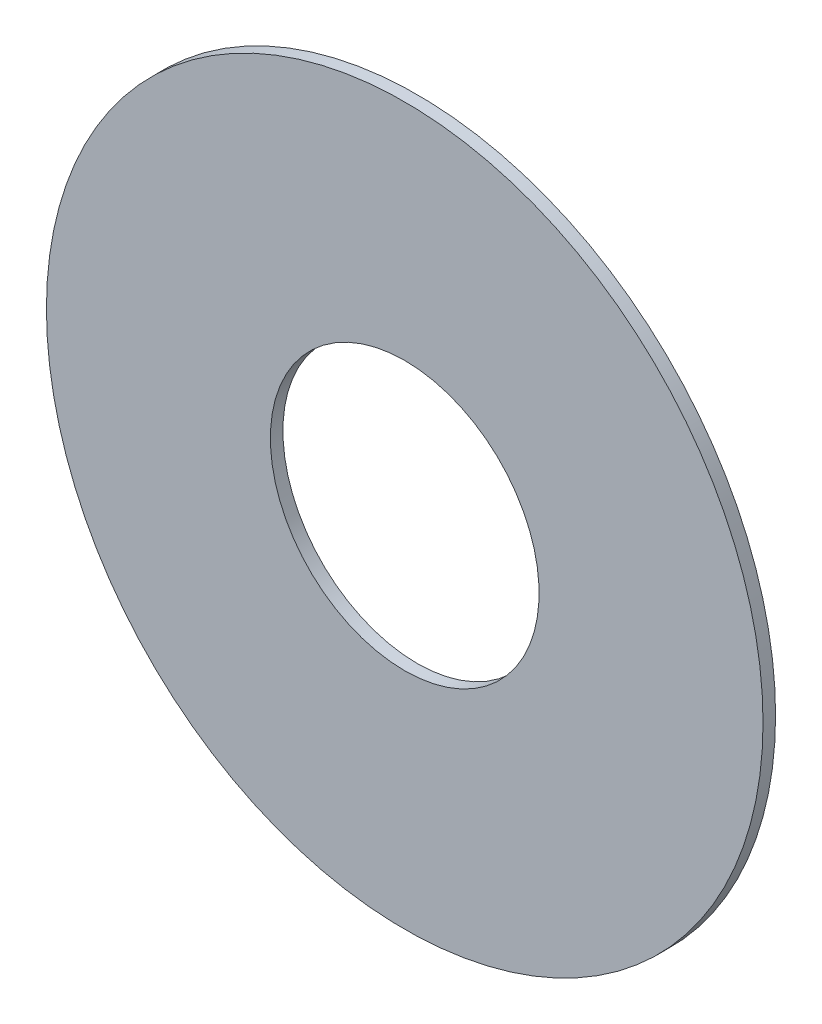
ISO-10303-21;
HEADER;
FILE_DESCRIPTION(('STEP AP214'),'2;1');
FILE_NAME('part.step','',(''),(''),'','','');
FILE_SCHEMA(('AUTOMOTIVE_DESIGN { 1 0 10303 214 1 1 1 1 }'));
ENDSEC;
DATA;
#1=APPLICATION_CONTEXT('core data for automotive mechanical design processes');
#2=APPLICATION_PROTOCOL_DEFINITION('international standard','automotive_design',2000,#1);
#3=PRODUCT_CONTEXT('',#1,'mechanical');
#4=PRODUCT('Part','Part','',(#3));
#5=PRODUCT_RELATED_PRODUCT_CATEGORY('part','',(#4));
#6=PRODUCT_DEFINITION_FORMATION('','',#4);
#7=PRODUCT_DEFINITION_CONTEXT('part definition',#1,'design');
#8=PRODUCT_DEFINITION('design','',#6,#7);
#9=PRODUCT_DEFINITION_SHAPE('','',#8);
#10=(LENGTH_UNIT() NAMED_UNIT(*) SI_UNIT(.MILLI.,.METRE.));
#11=(NAMED_UNIT(*) PLANE_ANGLE_UNIT() SI_UNIT($,.RADIAN.));
#12=(NAMED_UNIT(*) SI_UNIT($,.STERADIAN.) SOLID_ANGLE_UNIT());
#13=UNCERTAINTY_MEASURE_WITH_UNIT(LENGTH_MEASURE(1.E-05),#10,'distance_accuracy_value','');
#14=(GEOMETRIC_REPRESENTATION_CONTEXT(3) GLOBAL_UNCERTAINTY_ASSIGNED_CONTEXT((#13)) GLOBAL_UNIT_ASSIGNED_CONTEXT((#10,
#11,#12)) REPRESENTATION_CONTEXT('',''));
#15=CARTESIAN_POINT('',(0.,0.,0.));
#16=DIRECTION('',(0.,0.,1.));
#17=DIRECTION('',(1.,0.,0.));
#18=AXIS2_PLACEMENT_3D('',#15,#16,#17);
#19=CARTESIAN_POINT('',(146.304,-73.152,-0.045));
#20=DIRECTION('',(0.,0.,-1.));
#21=DIRECTION('',(0.,-1.,0.));
#22=AXIS2_PLACEMENT_3D('',#19,#20,#21);
#23=CYLINDRICAL_SURFACE('',#22,0.375);
#24=CARTESIAN_POINT('',(146.304,-73.152,-0.035));
#25=DIRECTION('',(0.,0.,-1.));
#26=DIRECTION('',(0.,-1.,0.));
#27=AXIS2_PLACEMENT_3D('',#24,#25,#26);
#28=CIRCLE('',#27,0.375);
#29=CARTESIAN_POINT('',(146.304,-73.527,-0.035));
#30=VERTEX_POINT('',#29);
#31=EDGE_CURVE('E26',#30,#30,#28,.T.);
#32=ORIENTED_EDGE('',*,*,#31,.T.);
#33=DIRECTION('',(0.,0.,1.));
#34=VECTOR('',#33,1.);
#35=CARTESIAN_POINT('',(146.304,-73.527,-0.045));
#36=LINE('',#35,#34);
#37=CARTESIAN_POINT('',(146.304,-73.527,0.));
#38=VERTEX_POINT('',#37);
#39=EDGE_CURVE('E11',#30,#38,#36,.T.);
#40=ORIENTED_EDGE('',*,*,#39,.T.);
#41=CARTESIAN_POINT('',(146.304,-73.152,0.));
#42=DIRECTION('',(0.,0.,-1.));
#43=DIRECTION('',(0.,-1.,0.));
#44=AXIS2_PLACEMENT_3D('',#41,#42,#43);
#45=CIRCLE('',#44,0.375);
#46=EDGE_CURVE('E70',#38,#38,#45,.T.);
#47=ORIENTED_EDGE('',*,*,#46,.F.);
#48=ORIENTED_EDGE('',*,*,#39,.F.);
#49=EDGE_LOOP('',(#32,#40,#47,#48));
#50=FACE_BOUND('',#49,.T.);
#51=ADVANCED_FACE('F17',(#50),#23,.F.);
#52=CARTESIAN_POINT('',(146.304,-73.152,-0.035));
#53=DIRECTION('',(0.,0.,1.));
#54=DIRECTION('',(1.,0.,0.));
#55=AXIS2_PLACEMENT_3D('',#52,#53,#54);
#56=PLANE('',#55);
#57=ORIENTED_EDGE('',*,*,#31,.F.);
#58=EDGE_LOOP('',(#57));
#59=FACE_BOUND('',#58,.T.);
#60=CARTESIAN_POINT('',(146.304,-73.152,-0.035));
#61=DIRECTION('',(0.,0.,1.));
#62=DIRECTION('',(1.,0.,0.));
#63=AXIS2_PLACEMENT_3D('',#60,#61,#62);
#64=CIRCLE('',#63,1.);
#65=CARTESIAN_POINT('',(147.304,-73.152,-0.035));
#66=VERTEX_POINT('',#65);
#67=EDGE_CURVE('E57',#66,#66,#64,.T.);
#68=ORIENTED_EDGE('',*,*,#67,.F.);
#69=EDGE_LOOP('',(#68));
#70=FACE_BOUND('',#69,.T.);
#71=ADVANCED_FACE('F19',(#59,#70),#56,.F.);
#72=CARTESIAN_POINT('',(146.304,-73.152,0.));
#73=DIRECTION('',(0.,0.,1.));
#74=DIRECTION('',(1.,0.,0.));
#75=AXIS2_PLACEMENT_3D('',#72,#73,#74);
#76=PLANE('',#75);
#77=ORIENTED_EDGE('',*,*,#46,.T.);
#78=EDGE_LOOP('',(#77));
#79=FACE_BOUND('',#78,.T.);
#80=CARTESIAN_POINT('',(146.304,-73.152,0.));
#81=DIRECTION('',(0.,0.,1.));
#82=DIRECTION('',(1.,0.,0.));
#83=AXIS2_PLACEMENT_3D('',#80,#81,#82);
#84=CIRCLE('',#83,1.);
#85=CARTESIAN_POINT('',(147.304,-73.152,0.));
#86=VERTEX_POINT('',#85);
#87=EDGE_CURVE('E55',#86,#86,#84,.T.);
#88=ORIENTED_EDGE('',*,*,#87,.T.);
#89=EDGE_LOOP('',(#88));
#90=FACE_BOUND('',#89,.T.);
#91=ADVANCED_FACE('F61',(#79,#90),#76,.T.);
#92=CARTESIAN_POINT('',(146.304,-73.152,-0.035));
#93=DIRECTION('',(0.,0.,1.));
#94=DIRECTION('',(1.,0.,0.));
#95=AXIS2_PLACEMENT_3D('',#92,#93,#94);
#96=CYLINDRICAL_SURFACE('',#95,1.);
#97=ORIENTED_EDGE('',*,*,#87,.F.);
#98=DIRECTION('',(0.,0.,1.));
#99=VECTOR('',#98,1.);
#100=CARTESIAN_POINT('',(147.304,-73.152,-0.035));
#101=LINE('',#100,#99);
#102=EDGE_CURVE('E52',#66,#86,#101,.T.);
#103=ORIENTED_EDGE('',*,*,#102,.F.);
#104=ORIENTED_EDGE('',*,*,#67,.T.);
#105=ORIENTED_EDGE('',*,*,#102,.T.);
#106=EDGE_LOOP('',(#97,#103,#104,#105));
#107=FACE_BOUND('',#106,.T.);
#108=ADVANCED_FACE('F54',(#107),#96,.T.);
#109=CLOSED_SHELL('',(#51,#71,#91,#108));
#110=MANIFOLD_SOLID_BREP('B1',#109);
#111=ADVANCED_BREP_SHAPE_REPRESENTATION('',(#18,#110),#14);
#112=SHAPE_DEFINITION_REPRESENTATION(#9,#111);
ENDSEC;
END-ISO-10303-21;
